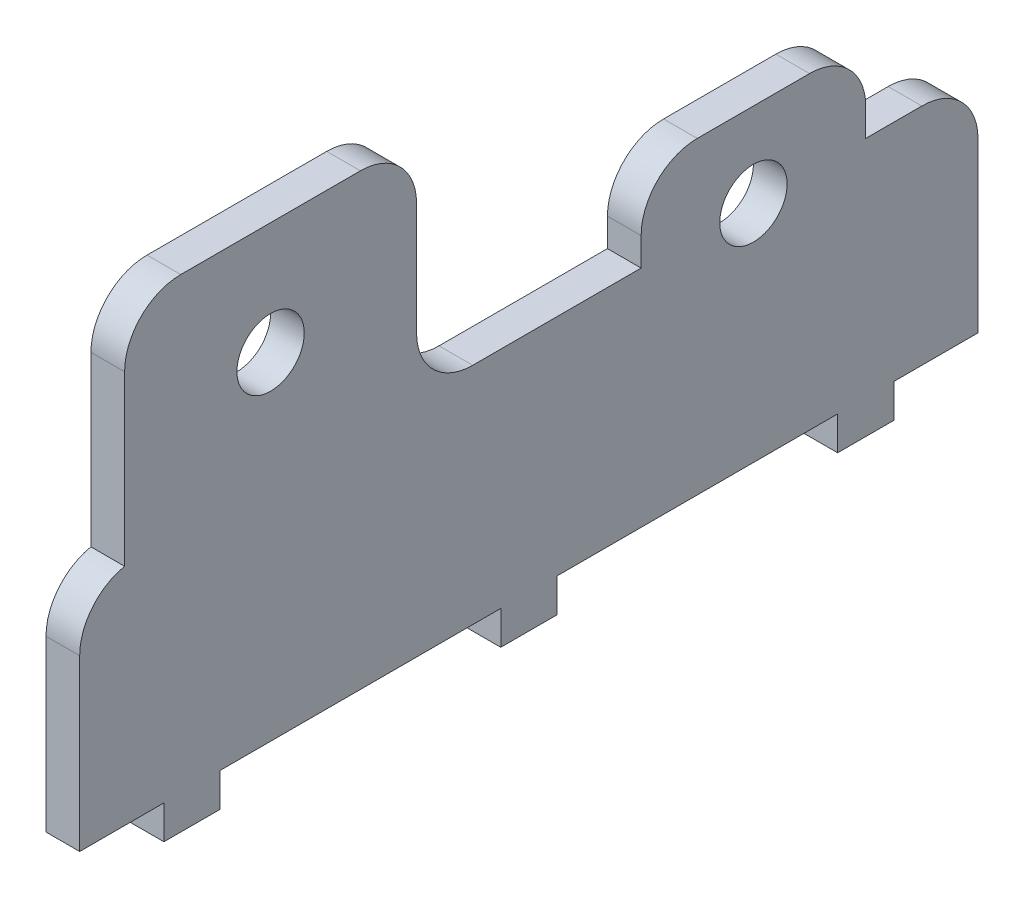
ISO-10303-21;
HEADER;
FILE_DESCRIPTION(('STEP AP214'),'2;1');
FILE_NAME('part.step','',(''),(''),'','','');
FILE_SCHEMA(('AUTOMOTIVE_DESIGN { 1 0 10303 214 1 1 1 1 }'));
ENDSEC;
DATA;
#1=APPLICATION_CONTEXT('core data for automotive mechanical design processes');
#2=APPLICATION_PROTOCOL_DEFINITION('international standard','automotive_design',2000,#1);
#3=PRODUCT_CONTEXT('',#1,'mechanical');
#4=PRODUCT('Part','Part','',(#3));
#5=PRODUCT_RELATED_PRODUCT_CATEGORY('part','',(#4));
#6=PRODUCT_DEFINITION_FORMATION('','',#4);
#7=PRODUCT_DEFINITION_CONTEXT('part definition',#1,'design');
#8=PRODUCT_DEFINITION('design','',#6,#7);
#9=PRODUCT_DEFINITION_SHAPE('','',#8);
#10=(LENGTH_UNIT() NAMED_UNIT(*) SI_UNIT(.MILLI.,.METRE.));
#11=(NAMED_UNIT(*) PLANE_ANGLE_UNIT() SI_UNIT($,.RADIAN.));
#12=(NAMED_UNIT(*) SI_UNIT($,.STERADIAN.) SOLID_ANGLE_UNIT());
#13=UNCERTAINTY_MEASURE_WITH_UNIT(LENGTH_MEASURE(1.E-05),#10,'distance_accuracy_value','');
#14=(GEOMETRIC_REPRESENTATION_CONTEXT(3) GLOBAL_UNCERTAINTY_ASSIGNED_CONTEXT((#13)) GLOBAL_UNIT_ASSIGNED_CONTEXT((#10,
#11,#12)) REPRESENTATION_CONTEXT('',''));
#15=CARTESIAN_POINT('',(0.,0.,0.));
#16=DIRECTION('',(0.,0.,1.));
#17=DIRECTION('',(1.,0.,0.));
#18=AXIS2_PLACEMENT_3D('',#15,#16,#17);
#19=CARTESIAN_POINT('',(3.,0.,-50.));
#20=DIRECTION('',(0.,1.,0.));
#21=DIRECTION('',(0.,0.,1.));
#22=AXIS2_PLACEMENT_3D('',#19,#20,#21);
#23=PLANE('',#22);
#24=DIRECTION('',(-1.,0.,0.));
#25=VECTOR('',#24,1.);
#26=CARTESIAN_POINT('',(3.,0.,22.5));
#27=LINE('',#26,#25);
#28=CARTESIAN_POINT('',(3.,0.,22.5));
#29=VERTEX_POINT('',#28);
#30=CARTESIAN_POINT('',(0.,0.,22.5));
#31=VERTEX_POINT('',#30);
#32=EDGE_CURVE('E62',#29,#31,#27,.T.);
#33=ORIENTED_EDGE('',*,*,#32,.F.);
#34=DIRECTION('',(0.,0.,-1.));
#35=VECTOR('',#34,1.);
#36=CARTESIAN_POINT('',(3.,0.,-50.));
#37=LINE('',#36,#35);
#38=CARTESIAN_POINT('',(3.,0.,30.));
#39=VERTEX_POINT('',#38);
#40=EDGE_CURVE('E261',#39,#29,#37,.T.);
#41=ORIENTED_EDGE('',*,*,#40,.F.);
#42=DIRECTION('',(-1.,0.,0.));
#43=VECTOR('',#42,1.);
#44=CARTESIAN_POINT('',(3.,0.,30.));
#45=LINE('',#44,#43);
#46=CARTESIAN_POINT('',(0.,0.,30.));
#47=VERTEX_POINT('',#46);
#48=EDGE_CURVE('E405',#39,#47,#45,.T.);
#49=ORIENTED_EDGE('',*,*,#48,.T.);
#50=DIRECTION('',(0.,0.,-1.));
#51=VECTOR('',#50,1.);
#52=CARTESIAN_POINT('',(0.,0.,-50.));
#53=LINE('',#52,#51);
#54=EDGE_CURVE('E395',#47,#31,#53,.T.);
#55=ORIENTED_EDGE('',*,*,#54,.T.);
#56=EDGE_LOOP('',(#33,#41,#49,#55));
#57=FACE_BOUND('',#56,.T.);
#58=ADVANCED_FACE('F39',(#57),#23,.F.);
#59=DIRECTION('',(1.,0.,0.));
#60=VECTOR('',#59,1.);
#61=CARTESIAN_POINT('',(3.,0.,17.5));
#62=LINE('',#61,#60);
#63=CARTESIAN_POINT('',(0.,0.,17.5));
#64=VERTEX_POINT('',#63);
#65=CARTESIAN_POINT('',(3.,0.,17.5));
#66=VERTEX_POINT('',#65);
#67=EDGE_CURVE('E256',#64,#66,#62,.T.);
#68=ORIENTED_EDGE('',*,*,#67,.F.);
#69=CARTESIAN_POINT('',(0.,0.,-7.50000000000001));
#70=VERTEX_POINT('',#69);
#71=EDGE_CURVE('E398',#64,#70,#53,.T.);
#72=ORIENTED_EDGE('',*,*,#71,.T.);
#73=DIRECTION('',(-1.,0.,0.));
#74=VECTOR('',#73,1.);
#75=CARTESIAN_POINT('',(3.,0.,-7.50000000000001));
#76=LINE('',#75,#74);
#77=CARTESIAN_POINT('',(3.,0.,-7.50000000000001));
#78=VERTEX_POINT('',#77);
#79=EDGE_CURVE('E262',#78,#70,#76,.T.);
#80=ORIENTED_EDGE('',*,*,#79,.F.);
#81=EDGE_CURVE('E54',#66,#78,#37,.T.);
#82=ORIENTED_EDGE('',*,*,#81,.F.);
#83=EDGE_LOOP('',(#68,#72,#80,#82));
#84=FACE_BOUND('',#83,.T.);
#85=ADVANCED_FACE('F540',(#84),#23,.F.);
#86=DIRECTION('',(1.,0.,0.));
#87=VECTOR('',#86,1.);
#88=CARTESIAN_POINT('',(3.,0.,-12.5));
#89=LINE('',#88,#87);
#90=CARTESIAN_POINT('',(0.,0.,-12.5));
#91=VERTEX_POINT('',#90);
#92=CARTESIAN_POINT('',(3.,0.,-12.5));
#93=VERTEX_POINT('',#92);
#94=EDGE_CURVE('E265',#91,#93,#89,.T.);
#95=ORIENTED_EDGE('',*,*,#94,.F.);
#96=CARTESIAN_POINT('',(0.,0.,-37.5));
#97=VERTEX_POINT('',#96);
#98=EDGE_CURVE('E526',#91,#97,#53,.T.);
#99=ORIENTED_EDGE('',*,*,#98,.T.);
#100=DIRECTION('',(-1.,0.,0.));
#101=VECTOR('',#100,1.);
#102=CARTESIAN_POINT('',(3.,0.,-37.5));
#103=LINE('',#102,#101);
#104=CARTESIAN_POINT('',(3.,0.,-37.5));
#105=VERTEX_POINT('',#104);
#106=EDGE_CURVE('E294',#105,#97,#103,.T.);
#107=ORIENTED_EDGE('',*,*,#106,.F.);
#108=EDGE_CURVE('E520',#93,#105,#37,.T.);
#109=ORIENTED_EDGE('',*,*,#108,.F.);
#110=EDGE_LOOP('',(#95,#99,#107,#109));
#111=FACE_BOUND('',#110,.T.);
#112=ADVANCED_FACE('F539',(#111),#23,.F.);
#113=DIRECTION('',(1.,0.,0.));
#114=VECTOR('',#113,1.);
#115=CARTESIAN_POINT('',(3.,0.,-42.5));
#116=LINE('',#115,#114);
#117=CARTESIAN_POINT('',(0.,0.,-42.5));
#118=VERTEX_POINT('',#117);
#119=CARTESIAN_POINT('',(3.,0.,-42.5));
#120=VERTEX_POINT('',#119);
#121=EDGE_CURVE('E299',#118,#120,#116,.T.);
#122=ORIENTED_EDGE('',*,*,#121,.F.);
#123=CARTESIAN_POINT('',(0.,0.,-50.));
#124=VERTEX_POINT('',#123);
#125=EDGE_CURVE('E394',#118,#124,#53,.T.);
#126=ORIENTED_EDGE('',*,*,#125,.T.);
#127=DIRECTION('',(-1.,0.,0.));
#128=VECTOR('',#127,1.);
#129=CARTESIAN_POINT('',(3.,0.,-50.));
#130=LINE('',#129,#128);
#131=CARTESIAN_POINT('',(3.,0.,-50.));
#132=VERTEX_POINT('',#131);
#133=EDGE_CURVE('E392',#132,#124,#130,.T.);
#134=ORIENTED_EDGE('',*,*,#133,.F.);
#135=EDGE_CURVE('E383',#120,#132,#37,.T.);
#136=ORIENTED_EDGE('',*,*,#135,.F.);
#137=EDGE_LOOP('',(#122,#126,#134,#136));
#138=FACE_BOUND('',#137,.T.);
#139=ADVANCED_FACE('F521',(#138),#23,.F.);
#140=CARTESIAN_POINT('',(3.,0.,30.));
#141=DIRECTION('',(0.,0.,-1.));
#142=DIRECTION('',(-1.,0.,0.));
#143=AXIS2_PLACEMENT_3D('',#140,#141,#142);
#144=PLANE('',#143);
#145=DIRECTION('',(0.,-1.,0.));
#146=VECTOR('',#145,1.);
#147=CARTESIAN_POINT('',(3.,0.,30.));
#148=LINE('',#147,#146);
#149=CARTESIAN_POINT('',(3.,15.1010205144336,30.));
#150=VERTEX_POINT('',#149);
#151=EDGE_CURVE('E381',#150,#39,#148,.T.);
#152=ORIENTED_EDGE('',*,*,#151,.F.);
#153=DIRECTION('',(1.,0.,0.));
#154=VECTOR('',#153,1.);
#155=CARTESIAN_POINT('',(3.,15.1010205144336,30.));
#156=LINE('',#155,#154);
#157=CARTESIAN_POINT('',(0.,15.1010205144336,30.));
#158=VERTEX_POINT('',#157);
#159=EDGE_CURVE('E420',#150,#158,#156,.F.);
#160=ORIENTED_EDGE('',*,*,#159,.T.);
#161=DIRECTION('',(0.,-1.,0.));
#162=VECTOR('',#161,1.);
#163=CARTESIAN_POINT('',(0.,0.,30.));
#164=LINE('',#163,#162);
#165=EDGE_CURVE('E378',#158,#47,#164,.T.);
#166=ORIENTED_EDGE('',*,*,#165,.T.);
#167=ORIENTED_EDGE('',*,*,#48,.F.);
#168=EDGE_LOOP('',(#152,#160,#166,#167));
#169=FACE_BOUND('',#168,.T.);
#170=ADVANCED_FACE('F572',(#169),#144,.F.);
#171=CARTESIAN_POINT('',(3.,0.,-50.));
#172=DIRECTION('',(0.,0.,1.));
#173=DIRECTION('',(1.,0.,0.));
#174=AXIS2_PLACEMENT_3D('',#171,#172,#173);
#175=PLANE('',#174);
#176=DIRECTION('',(0.,1.,0.));
#177=VECTOR('',#176,1.);
#178=CARTESIAN_POINT('',(0.,0.,-50.));
#179=LINE('',#178,#177);
#180=CARTESIAN_POINT('',(0.,15.,-50.));
#181=VERTEX_POINT('',#180);
#182=EDGE_CURVE('E397',#124,#181,#179,.T.);
#183=ORIENTED_EDGE('',*,*,#182,.T.);
#184=DIRECTION('',(1.,0.,0.));
#185=VECTOR('',#184,1.);
#186=CARTESIAN_POINT('',(3.,15.,-50.));
#187=LINE('',#186,#185);
#188=CARTESIAN_POINT('',(3.,15.,-50.));
#189=VERTEX_POINT('',#188);
#190=EDGE_CURVE('E449',#181,#189,#187,.T.);
#191=ORIENTED_EDGE('',*,*,#190,.T.);
#192=DIRECTION('',(0.,1.,0.));
#193=VECTOR('',#192,1.);
#194=CARTESIAN_POINT('',(3.,0.,-50.));
#195=LINE('',#194,#193);
#196=EDGE_CURVE('E386',#132,#189,#195,.T.);
#197=ORIENTED_EDGE('',*,*,#196,.F.);
#198=ORIENTED_EDGE('',*,*,#133,.T.);
#199=EDGE_LOOP('',(#183,#191,#197,#198));
#200=FACE_BOUND('',#199,.T.);
#201=ADVANCED_FACE('F515',(#200),#175,.F.);
#202=CARTESIAN_POINT('',(3.,40.,-50.));
#203=DIRECTION('',(0.,-1.,0.));
#204=DIRECTION('',(0.,0.,-1.));
#205=AXIS2_PLACEMENT_3D('',#202,#203,#204);
#206=PLANE('',#205);
#207=DIRECTION('',(0.,0.,1.));
#208=VECTOR('',#207,1.);
#209=CARTESIAN_POINT('',(0.,40.,-50.));
#210=LINE('',#209,#208);
#211=CARTESIAN_POINT('',(0.,40.,5.));
#212=VERTEX_POINT('',#211);
#213=CARTESIAN_POINT('',(0.,40.,21.));
#214=VERTEX_POINT('',#213);
#215=EDGE_CURVE('E384',#212,#214,#210,.T.);
#216=ORIENTED_EDGE('',*,*,#215,.T.);
#217=DIRECTION('',(1.,0.,0.));
#218=VECTOR('',#217,1.);
#219=CARTESIAN_POINT('',(3.,40.,21.));
#220=LINE('',#219,#218);
#221=CARTESIAN_POINT('',(3.,40.,21.));
#222=VERTEX_POINT('',#221);
#223=EDGE_CURVE('E436',#214,#222,#220,.T.);
#224=ORIENTED_EDGE('',*,*,#223,.T.);
#225=DIRECTION('',(0.,0.,1.));
#226=VECTOR('',#225,1.);
#227=CARTESIAN_POINT('',(3.,40.,-50.));
#228=LINE('',#227,#226);
#229=CARTESIAN_POINT('',(3.,40.,5.));
#230=VERTEX_POINT('',#229);
#231=EDGE_CURVE('E389',#230,#222,#228,.T.);
#232=ORIENTED_EDGE('',*,*,#231,.F.);
#233=DIRECTION('',(1.,0.,0.));
#234=VECTOR('',#233,1.);
#235=CARTESIAN_POINT('',(3.,40.,5.));
#236=LINE('',#235,#234);
#237=EDGE_CURVE('E434',#230,#212,#236,.F.);
#238=ORIENTED_EDGE('',*,*,#237,.T.);
#239=EDGE_LOOP('',(#216,#224,#232,#238));
#240=FACE_BOUND('',#239,.T.);
#241=ADVANCED_FACE('F750',(#240),#206,.F.);
#242=CARTESIAN_POINT('',(3.,0.,0.));
#243=DIRECTION('',(1.,0.,0.));
#244=DIRECTION('',(0.,0.,-1.));
#245=AXIS2_PLACEMENT_3D('',#242,#243,#244);
#246=PLANE('',#245);
#247=DIRECTION('',(0.,1.,0.));
#248=VECTOR('',#247,1.);
#249=CARTESIAN_POINT('',(3.,40.,26.));
#250=LINE('',#249,#248);
#251=CARTESIAN_POINT('',(3.,20.,26.));
#252=VERTEX_POINT('',#251);
#253=CARTESIAN_POINT('',(3.,35.,26.));
#254=VERTEX_POINT('',#253);
#255=EDGE_CURVE('E321',#252,#254,#250,.T.);
#256=ORIENTED_EDGE('',*,*,#255,.F.);
#257=CARTESIAN_POINT('',(3.,15.1010205144336,25.));
#258=DIRECTION('',(1.,0.,0.));
#259=DIRECTION('',(0.,0.,-1.));
#260=AXIS2_PLACEMENT_3D('',#257,#258,#259);
#261=CIRCLE('',#260,5.);
#262=EDGE_CURVE('E418',#252,#150,#261,.T.);
#263=ORIENTED_EDGE('',*,*,#262,.T.);
#264=ORIENTED_EDGE('',*,*,#151,.T.);
#265=ORIENTED_EDGE('',*,*,#40,.T.);
#266=DIRECTION('',(0.,1.,0.));
#267=VECTOR('',#266,1.);
#268=CARTESIAN_POINT('',(3.,-3.,22.5));
#269=LINE('',#268,#267);
#270=CARTESIAN_POINT('',(3.,-3.,22.5));
#271=VERTEX_POINT('',#270);
#272=EDGE_CURVE('E241',#271,#29,#269,.T.);
#273=ORIENTED_EDGE('',*,*,#272,.F.);
#274=DIRECTION('',(0.,0.,1.));
#275=VECTOR('',#274,1.);
#276=CARTESIAN_POINT('',(3.,-3.,17.5));
#277=LINE('',#276,#275);
#278=CARTESIAN_POINT('',(3.,-3.,17.5));
#279=VERTEX_POINT('',#278);
#280=EDGE_CURVE('E247',#279,#271,#277,.T.);
#281=ORIENTED_EDGE('',*,*,#280,.F.);
#282=DIRECTION('',(0.,1.,0.));
#283=VECTOR('',#282,1.);
#284=CARTESIAN_POINT('',(3.,-3.,17.5));
#285=LINE('',#284,#283);
#286=EDGE_CURVE('E553',#279,#66,#285,.T.);
#287=ORIENTED_EDGE('',*,*,#286,.T.);
#288=ORIENTED_EDGE('',*,*,#81,.T.);
#289=DIRECTION('',(0.,1.,0.));
#290=VECTOR('',#289,1.);
#291=CARTESIAN_POINT('',(3.,-3.,-7.50000000000001));
#292=LINE('',#291,#290);
#293=CARTESIAN_POINT('',(3.,-3.,-7.50000000000001));
#294=VERTEX_POINT('',#293);
#295=EDGE_CURVE('E291',#294,#78,#292,.T.);
#296=ORIENTED_EDGE('',*,*,#295,.F.);
#297=DIRECTION('',(0.,0.,1.));
#298=VECTOR('',#297,1.);
#299=CARTESIAN_POINT('',(3.,-3.,-12.5));
#300=LINE('',#299,#298);
#301=CARTESIAN_POINT('',(3.,-3.,-12.5));
#302=VERTEX_POINT('',#301);
#303=EDGE_CURVE('E271',#302,#294,#300,.T.);
#304=ORIENTED_EDGE('',*,*,#303,.F.);
#305=DIRECTION('',(0.,1.,0.));
#306=VECTOR('',#305,1.);
#307=CARTESIAN_POINT('',(3.,-3.,-12.5));
#308=LINE('',#307,#306);
#309=EDGE_CURVE('E279',#302,#93,#308,.T.);
#310=ORIENTED_EDGE('',*,*,#309,.T.);
#311=ORIENTED_EDGE('',*,*,#108,.T.);
#312=DIRECTION('',(0.,1.,0.));
#313=VECTOR('',#312,1.);
#314=CARTESIAN_POINT('',(3.,-3.,-37.5));
#315=LINE('',#314,#313);
#316=CARTESIAN_POINT('',(3.,-3.,-37.5));
#317=VERTEX_POINT('',#316);
#318=EDGE_CURVE('E318',#317,#105,#315,.T.);
#319=ORIENTED_EDGE('',*,*,#318,.F.);
#320=DIRECTION('',(0.,0.,1.));
#321=VECTOR('',#320,1.);
#322=CARTESIAN_POINT('',(3.,-3.,-42.5));
#323=LINE('',#322,#321);
#324=CARTESIAN_POINT('',(3.,-3.,-42.5));
#325=VERTEX_POINT('',#324);
#326=EDGE_CURVE('E295',#325,#317,#323,.T.);
#327=ORIENTED_EDGE('',*,*,#326,.F.);
#328=DIRECTION('',(0.,1.,0.));
#329=VECTOR('',#328,1.);
#330=CARTESIAN_POINT('',(3.,-3.,-42.5));
#331=LINE('',#330,#329);
#332=EDGE_CURVE('E305',#325,#120,#331,.T.);
#333=ORIENTED_EDGE('',*,*,#332,.T.);
#334=ORIENTED_EDGE('',*,*,#135,.T.);
#335=ORIENTED_EDGE('',*,*,#196,.T.);
#336=CARTESIAN_POINT('',(3.,15.,-45.));
#337=DIRECTION('',(1.,0.,0.));
#338=DIRECTION('',(0.,0.,-1.));
#339=AXIS2_PLACEMENT_3D('',#336,#337,#338);
#340=CIRCLE('',#339,5.);
#341=CARTESIAN_POINT('',(3.,20.,-45.));
#342=VERTEX_POINT('',#341);
#343=EDGE_CURVE('E414',#189,#342,#340,.T.);
#344=ORIENTED_EDGE('',*,*,#343,.T.);
#345=DIRECTION('',(0.,0.,-1.));
#346=VECTOR('',#345,1.);
#347=CARTESIAN_POINT('',(3.,20.,-50.));
#348=LINE('',#347,#346);
#349=CARTESIAN_POINT('',(3.,20.,-40.));
#350=VERTEX_POINT('',#349);
#351=EDGE_CURVE('E342',#350,#342,#348,.T.);
#352=ORIENTED_EDGE('',*,*,#351,.F.);
#353=DIRECTION('',(0.,-1.,0.));
#354=VECTOR('',#353,1.);
#355=CARTESIAN_POINT('',(3.,27.5,-40.));
#356=LINE('',#355,#354);
#357=CARTESIAN_POINT('',(3.,22.5,-40.));
#358=VERTEX_POINT('',#357);
#359=EDGE_CURVE('E340',#358,#350,#356,.T.);
#360=ORIENTED_EDGE('',*,*,#359,.F.);
#361=CARTESIAN_POINT('',(3.,22.5,-35.));
#362=DIRECTION('',(1.,0.,0.));
#363=DIRECTION('',(0.,0.,-1.));
#364=AXIS2_PLACEMENT_3D('',#361,#362,#363);
#365=CIRCLE('',#364,5.);
#366=CARTESIAN_POINT('',(3.,27.5,-35.));
#367=VERTEX_POINT('',#366);
#368=EDGE_CURVE('E412',#358,#367,#365,.T.);
#369=ORIENTED_EDGE('',*,*,#368,.T.);
#370=DIRECTION('',(0.,0.,-1.));
#371=VECTOR('',#370,1.);
#372=CARTESIAN_POINT('',(3.,27.5,-20.));
#373=LINE('',#372,#371);
#374=CARTESIAN_POINT('',(3.,27.5,-25.));
#375=VERTEX_POINT('',#374);
#376=EDGE_CURVE('E325',#375,#367,#373,.T.);
#377=ORIENTED_EDGE('',*,*,#376,.F.);
#378=CARTESIAN_POINT('',(3.,22.5,-25.));
#379=DIRECTION('',(1.,0.,0.));
#380=DIRECTION('',(0.,0.,-1.));
#381=AXIS2_PLACEMENT_3D('',#378,#379,#380);
#382=CIRCLE('',#381,5.);
#383=CARTESIAN_POINT('',(3.,22.5,-20.));
#384=VERTEX_POINT('',#383);
#385=EDGE_CURVE('E410',#375,#384,#382,.T.);
#386=ORIENTED_EDGE('',*,*,#385,.T.);
#387=DIRECTION('',(0.,1.,0.));
#388=VECTOR('',#387,1.);
#389=CARTESIAN_POINT('',(3.,27.5,-20.));
#390=LINE('',#389,#388);
#391=CARTESIAN_POINT('',(3.,20.,-20.));
#392=VERTEX_POINT('',#391);
#393=EDGE_CURVE('E351',#392,#384,#390,.T.);
#394=ORIENTED_EDGE('',*,*,#393,.F.);
#395=DIRECTION('',(0.,0.,-1.));
#396=VECTOR('',#395,1.);
#397=CARTESIAN_POINT('',(3.,20.,0.));
#398=LINE('',#397,#396);
#399=CARTESIAN_POINT('',(3.,20.,-5.));
#400=VERTEX_POINT('',#399);
#401=EDGE_CURVE('E349',#400,#392,#398,.T.);
#402=ORIENTED_EDGE('',*,*,#401,.F.);
#403=CARTESIAN_POINT('',(3.,25.,-5.));
#404=DIRECTION('',(1.,0.,0.));
#405=DIRECTION('',(0.,0.,-1.));
#406=AXIS2_PLACEMENT_3D('',#403,#404,#405);
#407=CIRCLE('',#406,5.);
#408=CARTESIAN_POINT('',(3.,25.,0.));
#409=VERTEX_POINT('',#408);
#410=EDGE_CURVE('E47',#400,#409,#407,.F.);
#411=ORIENTED_EDGE('',*,*,#410,.T.);
#412=DIRECTION('',(0.,-1.,0.));
#413=VECTOR('',#412,1.);
#414=CARTESIAN_POINT('',(3.,27.5,0.));
#415=LINE('',#414,#413);
#416=CARTESIAN_POINT('',(3.,35.,0.));
#417=VERTEX_POINT('',#416);
#418=EDGE_CURVE('E346',#417,#409,#415,.T.);
#419=ORIENTED_EDGE('',*,*,#418,.F.);
#420=CARTESIAN_POINT('',(3.,35.,5.));
#421=DIRECTION('',(1.,0.,0.));
#422=DIRECTION('',(0.,0.,-1.));
#423=AXIS2_PLACEMENT_3D('',#420,#421,#422);
#424=CIRCLE('',#423,5.);
#425=EDGE_CURVE('E408',#417,#230,#424,.T.);
#426=ORIENTED_EDGE('',*,*,#425,.T.);
#427=ORIENTED_EDGE('',*,*,#231,.T.);
#428=CARTESIAN_POINT('',(3.,35.,21.));
#429=DIRECTION('',(1.,0.,0.));
#430=DIRECTION('',(0.,0.,-1.));
#431=AXIS2_PLACEMENT_3D('',#428,#429,#430);
#432=CIRCLE('',#431,5.);
#433=EDGE_CURVE('E416',#222,#254,#432,.T.);
#434=ORIENTED_EDGE('',*,*,#433,.T.);
#435=EDGE_LOOP('',(#256,#263,#264,#265,#273,#281,#287,#288,#296,#304,#310,#311,#319,#327,#333,
#334,#335,#344,#352,#360,#369,#377,#386,#394,#402,#411,#419,#426,#427,#434));
#436=FACE_BOUND('',#435,.T.);
#437=CARTESIAN_POINT('',(3.,20.,-30.));
#438=DIRECTION('',(1.,0.,0.));
#439=DIRECTION('',(0.,0.,-1.));
#440=AXIS2_PLACEMENT_3D('',#437,#438,#439);
#441=CIRCLE('',#440,2.99999999999999);
#442=CARTESIAN_POINT('',(3.,20.,-33.));
#443=VERTEX_POINT('',#442);
#444=EDGE_CURVE('E359',#443,#443,#441,.T.);
#445=ORIENTED_EDGE('',*,*,#444,.F.);
#446=EDGE_LOOP('',(#445));
#447=FACE_BOUND('',#446,.T.);
#448=CARTESIAN_POINT('',(3.,30.,13.));
#449=DIRECTION('',(1.,0.,0.));
#450=DIRECTION('',(0.,0.,-1.));
#451=AXIS2_PLACEMENT_3D('',#448,#449,#450);
#452=CIRCLE('',#451,3.);
#453=CARTESIAN_POINT('',(3.,30.,9.99999999999999));
#454=VERTEX_POINT('',#453);
#455=EDGE_CURVE('E365',#454,#454,#452,.T.);
#456=ORIENTED_EDGE('',*,*,#455,.F.);
#457=EDGE_LOOP('',(#456));
#458=FACE_BOUND('',#457,.T.);
#459=ADVANCED_FACE('F259',(#436,#447,#458),#246,.T.);
#460=CARTESIAN_POINT('',(0.,0.,0.));
#461=DIRECTION('',(1.,0.,0.));
#462=DIRECTION('',(0.,0.,-1.));
#463=AXIS2_PLACEMENT_3D('',#460,#461,#462);
#464=PLANE('',#463);
#465=CARTESIAN_POINT('',(0.,20.,-30.));
#466=DIRECTION('',(1.,0.,0.));
#467=DIRECTION('',(0.,0.,-1.));
#468=AXIS2_PLACEMENT_3D('',#465,#466,#467);
#469=CIRCLE('',#468,2.99999999999999);
#470=CARTESIAN_POINT('',(0.,20.,-33.));
#471=VERTEX_POINT('',#470);
#472=EDGE_CURVE('E362',#471,#471,#469,.T.);
#473=ORIENTED_EDGE('',*,*,#472,.T.);
#474=EDGE_LOOP('',(#473));
#475=FACE_BOUND('',#474,.T.);
#476=CARTESIAN_POINT('',(0.,30.,13.));
#477=DIRECTION('',(1.,0.,0.));
#478=DIRECTION('',(0.,0.,-1.));
#479=AXIS2_PLACEMENT_3D('',#476,#477,#478);
#480=CIRCLE('',#479,3.);
#481=CARTESIAN_POINT('',(0.,30.,9.99999999999999));
#482=VERTEX_POINT('',#481);
#483=EDGE_CURVE('E375',#482,#482,#480,.T.);
#484=ORIENTED_EDGE('',*,*,#483,.T.);
#485=EDGE_LOOP('',(#484));
#486=FACE_BOUND('',#485,.T.);
#487=ORIENTED_EDGE('',*,*,#165,.F.);
#488=CARTESIAN_POINT('',(0.,15.1010205144336,25.));
#489=DIRECTION('',(1.,0.,0.));
#490=DIRECTION('',(0.,0.,-1.));
#491=AXIS2_PLACEMENT_3D('',#488,#489,#490);
#492=CIRCLE('',#491,5.);
#493=CARTESIAN_POINT('',(0.,20.,26.));
#494=VERTEX_POINT('',#493);
#495=EDGE_CURVE('E432',#158,#494,#492,.F.);
#496=ORIENTED_EDGE('',*,*,#495,.T.);
#497=DIRECTION('',(0.,1.,0.));
#498=VECTOR('',#497,1.);
#499=CARTESIAN_POINT('',(0.,40.,26.));
#500=LINE('',#499,#498);
#501=CARTESIAN_POINT('',(0.,35.,26.));
#502=VERTEX_POINT('',#501);
#503=EDGE_CURVE('E368',#494,#502,#500,.T.);
#504=ORIENTED_EDGE('',*,*,#503,.T.);
#505=CARTESIAN_POINT('',(0.,35.,21.));
#506=DIRECTION('',(1.,0.,0.));
#507=DIRECTION('',(0.,0.,-1.));
#508=AXIS2_PLACEMENT_3D('',#505,#506,#507);
#509=CIRCLE('',#508,5.);
#510=EDGE_CURVE('E430',#502,#214,#509,.F.);
#511=ORIENTED_EDGE('',*,*,#510,.T.);
#512=ORIENTED_EDGE('',*,*,#215,.F.);
#513=CARTESIAN_POINT('',(0.,35.,5.));
#514=DIRECTION('',(1.,0.,0.));
#515=DIRECTION('',(0.,0.,-1.));
#516=AXIS2_PLACEMENT_3D('',#513,#514,#515);
#517=CIRCLE('',#516,5.);
#518=CARTESIAN_POINT('',(0.,35.,0.));
#519=VERTEX_POINT('',#518);
#520=EDGE_CURVE('E422',#212,#519,#517,.F.);
#521=ORIENTED_EDGE('',*,*,#520,.T.);
#522=DIRECTION('',(0.,-1.,0.));
#523=VECTOR('',#522,1.);
#524=CARTESIAN_POINT('',(0.,40.,0.));
#525=LINE('',#524,#523);
#526=CARTESIAN_POINT('',(0.,25.,0.));
#527=VERTEX_POINT('',#526);
#528=EDGE_CURVE('E328',#519,#527,#525,.T.);
#529=ORIENTED_EDGE('',*,*,#528,.T.);
#530=CARTESIAN_POINT('',(0.,25.,-5.));
#531=DIRECTION('',(1.,0.,0.));
#532=DIRECTION('',(0.,0.,-1.));
#533=AXIS2_PLACEMENT_3D('',#530,#531,#532);
#534=CIRCLE('',#533,5.);
#535=CARTESIAN_POINT('',(0.,20.,-5.));
#536=VERTEX_POINT('',#535);
#537=EDGE_CURVE('E11',#527,#536,#534,.T.);
#538=ORIENTED_EDGE('',*,*,#537,.T.);
#539=DIRECTION('',(0.,0.,-1.));
#540=VECTOR('',#539,1.);
#541=CARTESIAN_POINT('',(0.,20.,0.));
#542=LINE('',#541,#540);
#543=CARTESIAN_POINT('',(0.,20.,-20.));
#544=VERTEX_POINT('',#543);
#545=EDGE_CURVE('E331',#536,#544,#542,.T.);
#546=ORIENTED_EDGE('',*,*,#545,.T.);
#547=DIRECTION('',(0.,1.,0.));
#548=VECTOR('',#547,1.);
#549=CARTESIAN_POINT('',(0.,27.5,-20.));
#550=LINE('',#549,#548);
#551=CARTESIAN_POINT('',(0.,22.5,-20.));
#552=VERTEX_POINT('',#551);
#553=EDGE_CURVE('E333',#544,#552,#550,.T.);
#554=ORIENTED_EDGE('',*,*,#553,.T.);
#555=CARTESIAN_POINT('',(0.,22.5,-25.));
#556=DIRECTION('',(1.,0.,0.));
#557=DIRECTION('',(0.,0.,-1.));
#558=AXIS2_PLACEMENT_3D('',#555,#556,#557);
#559=CIRCLE('',#558,5.);
#560=CARTESIAN_POINT('',(0.,27.5,-25.));
#561=VERTEX_POINT('',#560);
#562=EDGE_CURVE('E424',#552,#561,#559,.F.);
#563=ORIENTED_EDGE('',*,*,#562,.T.);
#564=DIRECTION('',(0.,0.,-1.));
#565=VECTOR('',#564,1.);
#566=CARTESIAN_POINT('',(0.,27.5,-20.));
#567=LINE('',#566,#565);
#568=CARTESIAN_POINT('',(0.,27.5,-35.));
#569=VERTEX_POINT('',#568);
#570=EDGE_CURVE('E336',#561,#569,#567,.T.);
#571=ORIENTED_EDGE('',*,*,#570,.T.);
#572=CARTESIAN_POINT('',(0.,22.5,-35.));
#573=DIRECTION('',(1.,0.,0.));
#574=DIRECTION('',(0.,0.,-1.));
#575=AXIS2_PLACEMENT_3D('',#572,#573,#574);
#576=CIRCLE('',#575,5.);
#577=CARTESIAN_POINT('',(0.,22.5,-40.));
#578=VERTEX_POINT('',#577);
#579=EDGE_CURVE('E426',#569,#578,#576,.F.);
#580=ORIENTED_EDGE('',*,*,#579,.T.);
#581=DIRECTION('',(0.,-1.,0.));
#582=VECTOR('',#581,1.);
#583=CARTESIAN_POINT('',(0.,27.5,-40.));
#584=LINE('',#583,#582);
#585=CARTESIAN_POINT('',(0.,20.,-40.));
#586=VERTEX_POINT('',#585);
#587=EDGE_CURVE('E322',#578,#586,#584,.T.);
#588=ORIENTED_EDGE('',*,*,#587,.T.);
#589=DIRECTION('',(0.,0.,-1.));
#590=VECTOR('',#589,1.);
#591=CARTESIAN_POINT('',(0.,20.,-50.));
#592=LINE('',#591,#590);
#593=CARTESIAN_POINT('',(0.,20.,-45.));
#594=VERTEX_POINT('',#593);
#595=EDGE_CURVE('E324',#586,#594,#592,.T.);
#596=ORIENTED_EDGE('',*,*,#595,.T.);
#597=CARTESIAN_POINT('',(0.,15.,-45.));
#598=DIRECTION('',(1.,0.,0.));
#599=DIRECTION('',(0.,0.,-1.));
#600=AXIS2_PLACEMENT_3D('',#597,#598,#599);
#601=CIRCLE('',#600,5.);
#602=EDGE_CURVE('E428',#594,#181,#601,.F.);
#603=ORIENTED_EDGE('',*,*,#602,.T.);
#604=ORIENTED_EDGE('',*,*,#182,.F.);
#605=ORIENTED_EDGE('',*,*,#125,.F.);
#606=DIRECTION('',(0.,1.,0.));
#607=VECTOR('',#606,1.);
#608=CARTESIAN_POINT('',(0.,-3.,-42.5));
#609=LINE('',#608,#607);
#610=CARTESIAN_POINT('',(0.,-3.,-42.5));
#611=VERTEX_POINT('',#610);
#612=EDGE_CURVE('E312',#611,#118,#609,.T.);
#613=ORIENTED_EDGE('',*,*,#612,.F.);
#614=DIRECTION('',(0.,0.,-1.));
#615=VECTOR('',#614,1.);
#616=CARTESIAN_POINT('',(0.,-3.,-42.5));
#617=LINE('',#616,#615);
#618=CARTESIAN_POINT('',(0.,-3.,-37.5));
#619=VERTEX_POINT('',#618);
#620=EDGE_CURVE('E301',#619,#611,#617,.T.);
#621=ORIENTED_EDGE('',*,*,#620,.F.);
#622=DIRECTION('',(0.,1.,0.));
#623=VECTOR('',#622,1.);
#624=CARTESIAN_POINT('',(0.,-3.,-37.5));
#625=LINE('',#624,#623);
#626=EDGE_CURVE('E315',#619,#97,#625,.T.);
#627=ORIENTED_EDGE('',*,*,#626,.T.);
#628=ORIENTED_EDGE('',*,*,#98,.F.);
#629=DIRECTION('',(0.,1.,0.));
#630=VECTOR('',#629,1.);
#631=CARTESIAN_POINT('',(0.,-3.,-12.5));
#632=LINE('',#631,#630);
#633=CARTESIAN_POINT('',(0.,-3.,-12.5));
#634=VERTEX_POINT('',#633);
#635=EDGE_CURVE('E285',#634,#91,#632,.T.);
#636=ORIENTED_EDGE('',*,*,#635,.F.);
#637=DIRECTION('',(0.,0.,-1.));
#638=VECTOR('',#637,1.);
#639=CARTESIAN_POINT('',(0.,-3.,-12.5));
#640=LINE('',#639,#638);
#641=CARTESIAN_POINT('',(0.,-3.,-7.50000000000001));
#642=VERTEX_POINT('',#641);
#643=EDGE_CURVE('E276',#642,#634,#640,.T.);
#644=ORIENTED_EDGE('',*,*,#643,.F.);
#645=DIRECTION('',(0.,1.,0.));
#646=VECTOR('',#645,1.);
#647=CARTESIAN_POINT('',(0.,-3.,-7.50000000000001));
#648=LINE('',#647,#646);
#649=EDGE_CURVE('E288',#642,#70,#648,.T.);
#650=ORIENTED_EDGE('',*,*,#649,.T.);
#651=ORIENTED_EDGE('',*,*,#71,.F.);
#652=DIRECTION('',(0.,1.,0.));
#653=VECTOR('',#652,1.);
#654=CARTESIAN_POINT('',(0.,-3.,17.5));
#655=LINE('',#654,#653);
#656=CARTESIAN_POINT('',(0.,-3.,17.5));
#657=VERTEX_POINT('',#656);
#658=EDGE_CURVE('E267',#657,#64,#655,.T.);
#659=ORIENTED_EDGE('',*,*,#658,.F.);
#660=DIRECTION('',(0.,0.,-1.));
#661=VECTOR('',#660,1.);
#662=CARTESIAN_POINT('',(0.,-3.,17.5));
#663=LINE('',#662,#661);
#664=CARTESIAN_POINT('',(0.,-3.,22.5));
#665=VERTEX_POINT('',#664);
#666=EDGE_CURVE('E246',#665,#657,#663,.T.);
#667=ORIENTED_EDGE('',*,*,#666,.F.);
#668=DIRECTION('',(0.,1.,0.));
#669=VECTOR('',#668,1.);
#670=CARTESIAN_POINT('',(0.,-3.,22.5));
#671=LINE('',#670,#669);
#672=EDGE_CURVE('E243',#665,#31,#671,.T.);
#673=ORIENTED_EDGE('',*,*,#672,.T.);
#674=ORIENTED_EDGE('',*,*,#54,.F.);
#675=EDGE_LOOP('',(#487,#496,#504,#511,#512,#521,#529,#538,#546,#554,#563,#571,#580,#588,#596,
#603,#604,#605,#613,#621,#627,#628,#636,#644,#650,#651,#659,#667,#673,#674));
#676=FACE_BOUND('',#675,.T.);
#677=ADVANCED_FACE('F478',(#475,#486,#676),#464,.F.);
#678=CARTESIAN_POINT('',(0.,30.,13.));
#679=DIRECTION('',(1.,0.,0.));
#680=DIRECTION('',(0.,0.,-1.));
#681=AXIS2_PLACEMENT_3D('',#678,#679,#680);
#682=CYLINDRICAL_SURFACE('',#681,3.);
#683=ORIENTED_EDGE('',*,*,#483,.F.);
#684=EDGE_LOOP('',(#683));
#685=FACE_BOUND('',#684,.T.);
#686=ORIENTED_EDGE('',*,*,#455,.T.);
#687=EDGE_LOOP('',(#686));
#688=FACE_BOUND('',#687,.T.);
#689=ADVANCED_FACE('F743',(#685,#688),#682,.F.);
#690=CARTESIAN_POINT('',(0.,27.5,-40.));
#691=DIRECTION('',(0.,0.,1.));
#692=DIRECTION('',(1.,0.,0.));
#693=AXIS2_PLACEMENT_3D('',#690,#691,#692);
#694=PLANE('',#693);
#695=ORIENTED_EDGE('',*,*,#587,.F.);
#696=DIRECTION('',(1.,0.,0.));
#697=VECTOR('',#696,1.);
#698=CARTESIAN_POINT('',(0.,22.5,-40.));
#699=LINE('',#698,#697);
#700=EDGE_CURVE('E454',#578,#358,#699,.T.);
#701=ORIENTED_EDGE('',*,*,#700,.T.);
#702=ORIENTED_EDGE('',*,*,#359,.T.);
#703=DIRECTION('',(1.,0.,0.));
#704=VECTOR('',#703,1.);
#705=CARTESIAN_POINT('',(0.,20.,-40.));
#706=LINE('',#705,#704);
#707=EDGE_CURVE('E339',#586,#350,#706,.T.);
#708=ORIENTED_EDGE('',*,*,#707,.F.);
#709=EDGE_LOOP('',(#695,#701,#702,#708));
#710=FACE_BOUND('',#709,.T.);
#711=ADVANCED_FACE('F503',(#710),#694,.F.);
#712=CARTESIAN_POINT('',(0.,27.5,-20.));
#713=DIRECTION('',(0.,-1.,0.));
#714=DIRECTION('',(0.,0.,-1.));
#715=AXIS2_PLACEMENT_3D('',#712,#713,#714);
#716=PLANE('',#715);
#717=ORIENTED_EDGE('',*,*,#376,.T.);
#718=DIRECTION('',(1.,0.,0.));
#719=VECTOR('',#718,1.);
#720=CARTESIAN_POINT('',(0.,27.5,-35.));
#721=LINE('',#720,#719);
#722=EDGE_CURVE('E460',#367,#569,#721,.F.);
#723=ORIENTED_EDGE('',*,*,#722,.T.);
#724=ORIENTED_EDGE('',*,*,#570,.F.);
#725=DIRECTION('',(1.,0.,0.));
#726=VECTOR('',#725,1.);
#727=CARTESIAN_POINT('',(0.,27.5,-25.));
#728=LINE('',#727,#726);
#729=EDGE_CURVE('E457',#561,#375,#728,.T.);
#730=ORIENTED_EDGE('',*,*,#729,.T.);
#731=EDGE_LOOP('',(#717,#723,#724,#730));
#732=FACE_BOUND('',#731,.T.);
#733=ADVANCED_FACE('F493',(#732),#716,.F.);
#734=CARTESIAN_POINT('',(0.,27.5,-20.));
#735=DIRECTION('',(0.,0.,-1.));
#736=DIRECTION('',(-1.,0.,0.));
#737=AXIS2_PLACEMENT_3D('',#734,#735,#736);
#738=PLANE('',#737);
#739=ORIENTED_EDGE('',*,*,#393,.T.);
#740=DIRECTION('',(1.,0.,0.));
#741=VECTOR('',#740,1.);
#742=CARTESIAN_POINT('',(0.,22.5,-20.));
#743=LINE('',#742,#741);
#744=EDGE_CURVE('E462',#384,#552,#743,.F.);
#745=ORIENTED_EDGE('',*,*,#744,.T.);
#746=ORIENTED_EDGE('',*,*,#553,.F.);
#747=DIRECTION('',(1.,0.,0.));
#748=VECTOR('',#747,1.);
#749=CARTESIAN_POINT('',(0.,20.,-20.));
#750=LINE('',#749,#748);
#751=EDGE_CURVE('E356',#544,#392,#750,.T.);
#752=ORIENTED_EDGE('',*,*,#751,.T.);
#753=EDGE_LOOP('',(#739,#745,#746,#752));
#754=FACE_BOUND('',#753,.T.);
#755=ADVANCED_FACE('F484',(#754),#738,.F.);
#756=CARTESIAN_POINT('',(0.,20.,0.));
#757=DIRECTION('',(0.,-1.,0.));
#758=DIRECTION('',(0.,0.,-1.));
#759=AXIS2_PLACEMENT_3D('',#756,#757,#758);
#760=PLANE('',#759);
#761=ORIENTED_EDGE('',*,*,#545,.F.);
#762=DIRECTION('',(1.,0.,0.));
#763=VECTOR('',#762,1.);
#764=CARTESIAN_POINT('',(3.,20.,-5.));
#765=LINE('',#764,#763);
#766=EDGE_CURVE('E441',#536,#400,#765,.T.);
#767=ORIENTED_EDGE('',*,*,#766,.T.);
#768=ORIENTED_EDGE('',*,*,#401,.T.);
#769=ORIENTED_EDGE('',*,*,#751,.F.);
#770=EDGE_LOOP('',(#761,#767,#768,#769));
#771=FACE_BOUND('',#770,.T.);
#772=ADVANCED_FACE('F481',(#771),#760,.F.);
#773=CARTESIAN_POINT('',(0.,27.5,0.));
#774=DIRECTION('',(0.,0.,1.));
#775=DIRECTION('',(1.,0.,0.));
#776=AXIS2_PLACEMENT_3D('',#773,#774,#775);
#777=PLANE('',#776);
#778=ORIENTED_EDGE('',*,*,#418,.T.);
#779=DIRECTION('',(1.,0.,0.));
#780=VECTOR('',#779,1.);
#781=CARTESIAN_POINT('',(0.,25.,0.));
#782=LINE('',#781,#780);
#783=EDGE_CURVE('E447',#409,#527,#782,.F.);
#784=ORIENTED_EDGE('',*,*,#783,.T.);
#785=ORIENTED_EDGE('',*,*,#528,.F.);
#786=DIRECTION('',(1.,0.,0.));
#787=VECTOR('',#786,1.);
#788=CARTESIAN_POINT('',(0.,35.,0.));
#789=LINE('',#788,#787);
#790=EDGE_CURVE('E444',#519,#417,#789,.T.);
#791=ORIENTED_EDGE('',*,*,#790,.T.);
#792=EDGE_LOOP('',(#778,#784,#785,#791));
#793=FACE_BOUND('',#792,.T.);
#794=ADVANCED_FACE('F470',(#793),#777,.F.);
#795=CARTESIAN_POINT('',(0.,20.,-50.));
#796=DIRECTION('',(0.,-1.,0.));
#797=DIRECTION('',(0.,0.,-1.));
#798=AXIS2_PLACEMENT_3D('',#795,#796,#797);
#799=PLANE('',#798);
#800=ORIENTED_EDGE('',*,*,#351,.T.);
#801=DIRECTION('',(1.,0.,0.));
#802=VECTOR('',#801,1.);
#803=CARTESIAN_POINT('',(0.,20.,-45.));
#804=LINE('',#803,#802);
#805=EDGE_CURVE('E452',#342,#594,#804,.F.);
#806=ORIENTED_EDGE('',*,*,#805,.T.);
#807=ORIENTED_EDGE('',*,*,#595,.F.);
#808=ORIENTED_EDGE('',*,*,#707,.T.);
#809=EDGE_LOOP('',(#800,#806,#807,#808));
#810=FACE_BOUND('',#809,.T.);
#811=ADVANCED_FACE('F697',(#810),#799,.F.);
#812=CARTESIAN_POINT('',(0.,20.,-30.));
#813=DIRECTION('',(1.,0.,0.));
#814=DIRECTION('',(0.,0.,-1.));
#815=AXIS2_PLACEMENT_3D('',#812,#813,#814);
#816=CYLINDRICAL_SURFACE('',#815,2.99999999999999);
#817=ORIENTED_EDGE('',*,*,#472,.F.);
#818=EDGE_LOOP('',(#817));
#819=FACE_BOUND('',#818,.T.);
#820=ORIENTED_EDGE('',*,*,#444,.T.);
#821=EDGE_LOOP('',(#820));
#822=FACE_BOUND('',#821,.T.);
#823=ADVANCED_FACE('F689',(#819,#822),#816,.F.);
#824=CARTESIAN_POINT('',(0.,40.,26.));
#825=DIRECTION('',(0.,0.,-1.));
#826=DIRECTION('',(0.,1.,0.));
#827=AXIS2_PLACEMENT_3D('',#824,#825,#826);
#828=PLANE('',#827);
#829=ORIENTED_EDGE('',*,*,#255,.T.);
#830=DIRECTION('',(1.,0.,0.));
#831=VECTOR('',#830,1.);
#832=CARTESIAN_POINT('',(0.,35.,26.));
#833=LINE('',#832,#831);
#834=EDGE_CURVE('E439',#254,#502,#833,.F.);
#835=ORIENTED_EDGE('',*,*,#834,.T.);
#836=ORIENTED_EDGE('',*,*,#503,.F.);
#837=DIRECTION('',(1.,0.,0.));
#838=VECTOR('',#837,1.);
#839=CARTESIAN_POINT('',(0.,20.,26.));
#840=LINE('',#839,#838);
#841=EDGE_CURVE('E343',#494,#252,#840,.T.);
#842=ORIENTED_EDGE('',*,*,#841,.T.);
#843=EDGE_LOOP('',(#829,#835,#836,#842));
#844=FACE_BOUND('',#843,.T.);
#845=ADVANCED_FACE('F679',(#844),#828,.F.);
#846=CARTESIAN_POINT('',(0.,15.1010205144336,25.));
#847=DIRECTION('',(1.,0.,0.));
#848=DIRECTION('',(0.,0.,-1.));
#849=AXIS2_PLACEMENT_3D('',#846,#847,#848);
#850=CYLINDRICAL_SURFACE('',#849,5.);
#851=ORIENTED_EDGE('',*,*,#495,.F.);
#852=ORIENTED_EDGE('',*,*,#159,.F.);
#853=ORIENTED_EDGE('',*,*,#262,.F.);
#854=ORIENTED_EDGE('',*,*,#841,.F.);
#855=EDGE_LOOP('',(#851,#852,#853,#854));
#856=FACE_BOUND('',#855,.T.);
#857=ADVANCED_FACE('F669',(#856),#850,.T.);
#858=CARTESIAN_POINT('',(3.,35.,21.));
#859=DIRECTION('',(1.,0.,0.));
#860=DIRECTION('',(0.,0.,-1.));
#861=AXIS2_PLACEMENT_3D('',#858,#859,#860);
#862=CYLINDRICAL_SURFACE('',#861,5.);
#863=ORIENTED_EDGE('',*,*,#510,.F.);
#864=ORIENTED_EDGE('',*,*,#834,.F.);
#865=ORIENTED_EDGE('',*,*,#433,.F.);
#866=ORIENTED_EDGE('',*,*,#223,.F.);
#867=EDGE_LOOP('',(#863,#864,#865,#866));
#868=FACE_BOUND('',#867,.T.);
#869=ADVANCED_FACE('F660',(#868),#862,.T.);
#870=CARTESIAN_POINT('',(0.,25.,-5.));
#871=DIRECTION('',(-1.,0.,0.));
#872=DIRECTION('',(0.,0.,1.));
#873=AXIS2_PLACEMENT_3D('',#870,#871,#872);
#874=CYLINDRICAL_SURFACE('',#873,5.);
#875=ORIENTED_EDGE('',*,*,#537,.F.);
#876=ORIENTED_EDGE('',*,*,#783,.F.);
#877=ORIENTED_EDGE('',*,*,#410,.F.);
#878=ORIENTED_EDGE('',*,*,#766,.F.);
#879=EDGE_LOOP('',(#875,#876,#877,#878));
#880=FACE_BOUND('',#879,.T.);
#881=ADVANCED_FACE('F474',(#880),#874,.F.);
#882=CARTESIAN_POINT('',(3.,15.,-45.));
#883=DIRECTION('',(1.,0.,0.));
#884=DIRECTION('',(0.,0.,-1.));
#885=AXIS2_PLACEMENT_3D('',#882,#883,#884);
#886=CYLINDRICAL_SURFACE('',#885,5.);
#887=ORIENTED_EDGE('',*,*,#602,.F.);
#888=ORIENTED_EDGE('',*,*,#805,.F.);
#889=ORIENTED_EDGE('',*,*,#343,.F.);
#890=ORIENTED_EDGE('',*,*,#190,.F.);
#891=EDGE_LOOP('',(#887,#888,#889,#890));
#892=FACE_BOUND('',#891,.T.);
#893=ADVANCED_FACE('F512',(#892),#886,.T.);
#894=CARTESIAN_POINT('',(0.,22.5,-35.));
#895=DIRECTION('',(1.,0.,0.));
#896=DIRECTION('',(0.,0.,-1.));
#897=AXIS2_PLACEMENT_3D('',#894,#895,#896);
#898=CYLINDRICAL_SURFACE('',#897,5.);
#899=ORIENTED_EDGE('',*,*,#579,.F.);
#900=ORIENTED_EDGE('',*,*,#722,.F.);
#901=ORIENTED_EDGE('',*,*,#368,.F.);
#902=ORIENTED_EDGE('',*,*,#700,.F.);
#903=EDGE_LOOP('',(#899,#900,#901,#902));
#904=FACE_BOUND('',#903,.T.);
#905=ADVANCED_FACE('F500',(#904),#898,.T.);
#906=CARTESIAN_POINT('',(0.,22.5,-25.));
#907=DIRECTION('',(1.,0.,0.));
#908=DIRECTION('',(0.,0.,-1.));
#909=AXIS2_PLACEMENT_3D('',#906,#907,#908);
#910=CYLINDRICAL_SURFACE('',#909,5.);
#911=ORIENTED_EDGE('',*,*,#562,.F.);
#912=ORIENTED_EDGE('',*,*,#744,.F.);
#913=ORIENTED_EDGE('',*,*,#385,.F.);
#914=ORIENTED_EDGE('',*,*,#729,.F.);
#915=EDGE_LOOP('',(#911,#912,#913,#914));
#916=FACE_BOUND('',#915,.T.);
#917=ADVANCED_FACE('F490',(#916),#910,.T.);
#918=CARTESIAN_POINT('',(0.,35.,5.));
#919=DIRECTION('',(1.,0.,0.));
#920=DIRECTION('',(0.,0.,-1.));
#921=AXIS2_PLACEMENT_3D('',#918,#919,#920);
#922=CYLINDRICAL_SURFACE('',#921,5.);
#923=ORIENTED_EDGE('',*,*,#520,.F.);
#924=ORIENTED_EDGE('',*,*,#237,.F.);
#925=ORIENTED_EDGE('',*,*,#425,.F.);
#926=ORIENTED_EDGE('',*,*,#790,.F.);
#927=EDGE_LOOP('',(#923,#924,#925,#926));
#928=FACE_BOUND('',#927,.T.);
#929=ADVANCED_FACE('F41',(#928),#922,.T.);
#930=CARTESIAN_POINT('',(3.,-3.,-37.5));
#931=DIRECTION('',(0.,0.,-1.));
#932=DIRECTION('',(0.,1.,0.));
#933=AXIS2_PLACEMENT_3D('',#930,#931,#932);
#934=PLANE('',#933);
#935=ORIENTED_EDGE('',*,*,#106,.T.);
#936=ORIENTED_EDGE('',*,*,#626,.F.);
#937=DIRECTION('',(-1.,0.,0.));
#938=VECTOR('',#937,1.);
#939=CARTESIAN_POINT('',(3.,-3.,-37.5));
#940=LINE('',#939,#938);
#941=EDGE_CURVE('E298',#317,#619,#940,.T.);
#942=ORIENTED_EDGE('',*,*,#941,.F.);
#943=ORIENTED_EDGE('',*,*,#318,.T.);
#944=EDGE_LOOP('',(#935,#936,#942,#943));
#945=FACE_BOUND('',#944,.T.);
#946=ADVANCED_FACE('F536',(#945),#934,.F.);
#947=CARTESIAN_POINT('',(3.,-3.,-42.5));
#948=DIRECTION('',(0.,0.,1.));
#949=DIRECTION('',(1.,0.,0.));
#950=AXIS2_PLACEMENT_3D('',#947,#948,#949);
#951=PLANE('',#950);
#952=ORIENTED_EDGE('',*,*,#121,.T.);
#953=ORIENTED_EDGE('',*,*,#332,.F.);
#954=DIRECTION('',(1.,0.,0.));
#955=VECTOR('',#954,1.);
#956=CARTESIAN_POINT('',(3.,-3.,-42.5));
#957=LINE('',#956,#955);
#958=EDGE_CURVE('E303',#611,#325,#957,.T.);
#959=ORIENTED_EDGE('',*,*,#958,.F.);
#960=ORIENTED_EDGE('',*,*,#612,.T.);
#961=EDGE_LOOP('',(#952,#953,#959,#960));
#962=FACE_BOUND('',#961,.T.);
#963=ADVANCED_FACE('F528',(#962),#951,.F.);
#964=CARTESIAN_POINT('',(0.,-3.,0.));
#965=DIRECTION('',(0.,-1.,0.));
#966=DIRECTION('',(0.,0.,-1.));
#967=AXIS2_PLACEMENT_3D('',#964,#965,#966);
#968=PLANE('',#967);
#969=ORIENTED_EDGE('',*,*,#326,.T.);
#970=ORIENTED_EDGE('',*,*,#941,.T.);
#971=ORIENTED_EDGE('',*,*,#620,.T.);
#972=ORIENTED_EDGE('',*,*,#958,.T.);
#973=EDGE_LOOP('',(#969,#970,#971,#972));
#974=FACE_BOUND('',#973,.T.);
#975=ADVANCED_FACE('F530',(#974),#968,.T.);
#976=CARTESIAN_POINT('',(3.,-3.,-7.50000000000001));
#977=DIRECTION('',(0.,0.,-1.));
#978=DIRECTION('',(0.,1.,0.));
#979=AXIS2_PLACEMENT_3D('',#976,#977,#978);
#980=PLANE('',#979);
#981=ORIENTED_EDGE('',*,*,#79,.T.);
#982=ORIENTED_EDGE('',*,*,#649,.F.);
#983=DIRECTION('',(-1.,0.,0.));
#984=VECTOR('',#983,1.);
#985=CARTESIAN_POINT('',(3.,-3.,-7.50000000000001));
#986=LINE('',#985,#984);
#987=EDGE_CURVE('E274',#294,#642,#986,.T.);
#988=ORIENTED_EDGE('',*,*,#987,.F.);
#989=ORIENTED_EDGE('',*,*,#295,.T.);
#990=EDGE_LOOP('',(#981,#982,#988,#989));
#991=FACE_BOUND('',#990,.T.);
#992=ADVANCED_FACE('F545',(#991),#980,.F.);
#993=CARTESIAN_POINT('',(3.,-3.,-12.5));
#994=DIRECTION('',(0.,0.,1.));
#995=DIRECTION('',(1.,0.,0.));
#996=AXIS2_PLACEMENT_3D('',#993,#994,#995);
#997=PLANE('',#996);
#998=ORIENTED_EDGE('',*,*,#94,.T.);
#999=ORIENTED_EDGE('',*,*,#309,.F.);
#1000=DIRECTION('',(1.,0.,0.));
#1001=VECTOR('',#1000,1.);
#1002=CARTESIAN_POINT('',(3.,-3.,-12.5));
#1003=LINE('',#1002,#1001);
#1004=EDGE_CURVE('E278',#634,#302,#1003,.T.);
#1005=ORIENTED_EDGE('',*,*,#1004,.F.);
#1006=ORIENTED_EDGE('',*,*,#635,.T.);
#1007=EDGE_LOOP('',(#998,#999,#1005,#1006));
#1008=FACE_BOUND('',#1007,.T.);
#1009=ADVANCED_FACE('F555',(#1008),#997,.F.);
#1010=CARTESIAN_POINT('',(0.,-3.,30.));
#1011=DIRECTION('',(0.,-1.,0.));
#1012=DIRECTION('',(0.,0.,-1.));
#1013=AXIS2_PLACEMENT_3D('',#1010,#1011,#1012);
#1014=PLANE('',#1013);
#1015=ORIENTED_EDGE('',*,*,#303,.T.);
#1016=ORIENTED_EDGE('',*,*,#987,.T.);
#1017=ORIENTED_EDGE('',*,*,#643,.T.);
#1018=ORIENTED_EDGE('',*,*,#1004,.T.);
#1019=EDGE_LOOP('',(#1015,#1016,#1017,#1018));
#1020=FACE_BOUND('',#1019,.T.);
#1021=ADVANCED_FACE('F550',(#1020),#1014,.T.);
#1022=CARTESIAN_POINT('',(3.,-3.,22.5));
#1023=DIRECTION('',(0.,0.,-1.));
#1024=DIRECTION('',(0.,1.,0.));
#1025=AXIS2_PLACEMENT_3D('',#1022,#1023,#1024);
#1026=PLANE('',#1025);
#1027=ORIENTED_EDGE('',*,*,#32,.T.);
#1028=ORIENTED_EDGE('',*,*,#672,.F.);
#1029=DIRECTION('',(-1.,0.,0.));
#1030=VECTOR('',#1029,1.);
#1031=CARTESIAN_POINT('',(3.,-3.,22.5));
#1032=LINE('',#1031,#1030);
#1033=EDGE_CURVE('E237',#271,#665,#1032,.T.);
#1034=ORIENTED_EDGE('',*,*,#1033,.F.);
#1035=ORIENTED_EDGE('',*,*,#272,.T.);
#1036=EDGE_LOOP('',(#1027,#1028,#1034,#1035));
#1037=FACE_BOUND('',#1036,.T.);
#1038=ADVANCED_FACE('F239',(#1037),#1026,.F.);
#1039=CARTESIAN_POINT('',(3.,-3.,17.5));
#1040=DIRECTION('',(0.,0.,1.));
#1041=DIRECTION('',(1.,0.,0.));
#1042=AXIS2_PLACEMENT_3D('',#1039,#1040,#1041);
#1043=PLANE('',#1042);
#1044=ORIENTED_EDGE('',*,*,#67,.T.);
#1045=ORIENTED_EDGE('',*,*,#286,.F.);
#1046=DIRECTION('',(1.,0.,0.));
#1047=VECTOR('',#1046,1.);
#1048=CARTESIAN_POINT('',(3.,-3.,17.5));
#1049=LINE('',#1048,#1047);
#1050=EDGE_CURVE('E252',#657,#279,#1049,.T.);
#1051=ORIENTED_EDGE('',*,*,#1050,.F.);
#1052=ORIENTED_EDGE('',*,*,#658,.T.);
#1053=EDGE_LOOP('',(#1044,#1045,#1051,#1052));
#1054=FACE_BOUND('',#1053,.T.);
#1055=ADVANCED_FACE('F830',(#1054),#1043,.F.);
#1056=CARTESIAN_POINT('',(0.,-3.00000000000001,60.));
#1057=DIRECTION('',(0.,-1.,0.));
#1058=DIRECTION('',(0.,0.,-1.));
#1059=AXIS2_PLACEMENT_3D('',#1056,#1057,#1058);
#1060=PLANE('',#1059);
#1061=ORIENTED_EDGE('',*,*,#280,.T.);
#1062=ORIENTED_EDGE('',*,*,#1033,.T.);
#1063=ORIENTED_EDGE('',*,*,#666,.T.);
#1064=ORIENTED_EDGE('',*,*,#1050,.T.);
#1065=EDGE_LOOP('',(#1061,#1062,#1063,#1064));
#1066=FACE_BOUND('',#1065,.T.);
#1067=ADVANCED_FACE('F250',(#1066),#1060,.T.);
#1068=CLOSED_SHELL('',(#58,#85,#112,#139,#170,#201,#241,#459,#677,#689,#711,#733,#755,#772,#794,
#811,#823,#845,#857,#869,#881,#893,#905,#917,#929,#946,#963,#975,#992,#1009,#1021,#1038,#1055,#1067));
#1069=MANIFOLD_SOLID_BREP('B2',#1068);
#1070=ADVANCED_BREP_SHAPE_REPRESENTATION('',(#18,#1069),#14);
#1071=SHAPE_DEFINITION_REPRESENTATION(#9,#1070);
ENDSEC;
END-ISO-10303-21;
